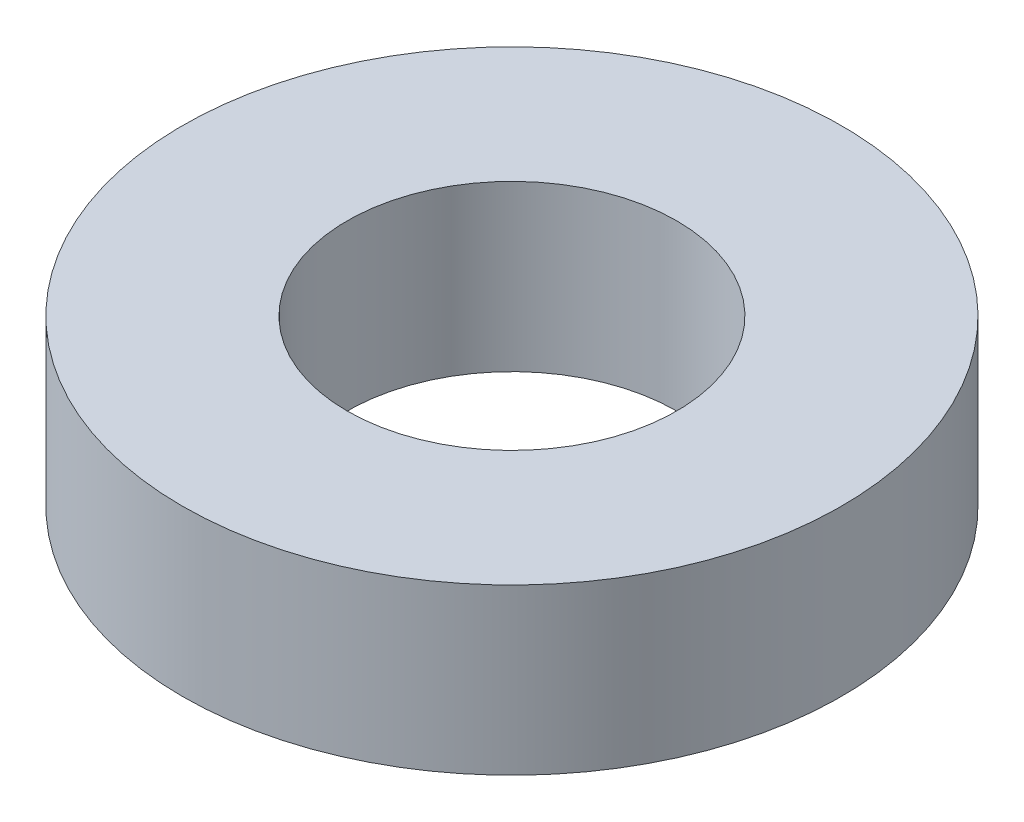
ISO-10303-21;
HEADER;
FILE_DESCRIPTION(('STEP AP214'),'2;1');
FILE_NAME('part.step','',(''),(''),'','','');
FILE_SCHEMA(('AUTOMOTIVE_DESIGN { 1 0 10303 214 1 1 1 1 }'));
ENDSEC;
DATA;
#1=APPLICATION_CONTEXT('core data for automotive mechanical design processes');
#2=APPLICATION_PROTOCOL_DEFINITION('international standard','automotive_design',2000,#1);
#3=PRODUCT_CONTEXT('',#1,'mechanical');
#4=PRODUCT('Part','Part','',(#3));
#5=PRODUCT_RELATED_PRODUCT_CATEGORY('part','',(#4));
#6=PRODUCT_DEFINITION_FORMATION('','',#4);
#7=PRODUCT_DEFINITION_CONTEXT('part definition',#1,'design');
#8=PRODUCT_DEFINITION('design','',#6,#7);
#9=PRODUCT_DEFINITION_SHAPE('','',#8);
#10=(LENGTH_UNIT() NAMED_UNIT(*) SI_UNIT(.MILLI.,.METRE.));
#11=(NAMED_UNIT(*) PLANE_ANGLE_UNIT() SI_UNIT($,.RADIAN.));
#12=(NAMED_UNIT(*) SI_UNIT($,.STERADIAN.) SOLID_ANGLE_UNIT());
#13=UNCERTAINTY_MEASURE_WITH_UNIT(LENGTH_MEASURE(1.E-05),#10,'distance_accuracy_value','');
#14=(GEOMETRIC_REPRESENTATION_CONTEXT(3) GLOBAL_UNCERTAINTY_ASSIGNED_CONTEXT((#13)) GLOBAL_UNIT_ASSIGNED_CONTEXT((#10,
#11,#12)) REPRESENTATION_CONTEXT('',''));
#15=CARTESIAN_POINT('',(0.,0.,0.));
#16=DIRECTION('',(0.,0.,1.));
#17=DIRECTION('',(1.,0.,0.));
#18=AXIS2_PLACEMENT_3D('',#15,#16,#17);
#19=CARTESIAN_POINT('',(0.,1.5,0.));
#20=DIRECTION('',(0.,-1.,0.));
#21=DIRECTION('',(0.,0.,-1.));
#22=AXIS2_PLACEMENT_3D('',#19,#20,#21);
#23=CYLINDRICAL_SURFACE('',#22,3.);
#24=CARTESIAN_POINT('',(0.,1.5,0.));
#25=DIRECTION('',(0.,1.,0.));
#26=DIRECTION('',(0.,0.,1.));
#27=AXIS2_PLACEMENT_3D('',#24,#25,#26);
#28=CIRCLE('',#27,3.);
#29=CARTESIAN_POINT('',(0.,1.5,3.));
#30=VERTEX_POINT('',#29);
#31=EDGE_CURVE('E10',#30,#30,#28,.T.);
#32=ORIENTED_EDGE('',*,*,#31,.F.);
#33=EDGE_LOOP('',(#32));
#34=FACE_BOUND('',#33,.T.);
#35=CARTESIAN_POINT('',(0.,0.,0.));
#36=DIRECTION('',(0.,1.,0.));
#37=DIRECTION('',(0.,0.,1.));
#38=AXIS2_PLACEMENT_3D('',#35,#36,#37);
#39=CIRCLE('',#38,3.);
#40=CARTESIAN_POINT('',(0.,0.,3.));
#41=VERTEX_POINT('',#40);
#42=EDGE_CURVE('E34',#41,#41,#39,.T.);
#43=ORIENTED_EDGE('',*,*,#42,.T.);
#44=EDGE_LOOP('',(#43));
#45=FACE_BOUND('',#44,.T.);
#46=ADVANCED_FACE('F31',(#34,#45),#23,.T.);
#47=CARTESIAN_POINT('',(0.,1.5,0.));
#48=DIRECTION('',(0.,1.,0.));
#49=DIRECTION('',(0.,0.,1.));
#50=AXIS2_PLACEMENT_3D('',#47,#48,#49);
#51=PLANE('',#50);
#52=CARTESIAN_POINT('',(0.,1.5,0.));
#53=DIRECTION('',(0.,1.,0.));
#54=DIRECTION('',(0.,0.,1.));
#55=AXIS2_PLACEMENT_3D('',#52,#53,#54);
#56=CIRCLE('',#55,1.5);
#57=CARTESIAN_POINT('',(0.,1.5,1.5));
#58=VERTEX_POINT('',#57);
#59=EDGE_CURVE('E45',#58,#58,#56,.T.);
#60=ORIENTED_EDGE('',*,*,#59,.F.);
#61=EDGE_LOOP('',(#60));
#62=FACE_BOUND('',#61,.T.);
#63=ORIENTED_EDGE('',*,*,#31,.T.);
#64=EDGE_LOOP('',(#63));
#65=FACE_BOUND('',#64,.T.);
#66=ADVANCED_FACE('F51',(#62,#65),#51,.T.);
#67=CARTESIAN_POINT('',(0.,0.,0.));
#68=DIRECTION('',(0.,1.,0.));
#69=DIRECTION('',(0.,0.,1.));
#70=AXIS2_PLACEMENT_3D('',#67,#68,#69);
#71=PLANE('',#70);
#72=CARTESIAN_POINT('',(0.,0.,0.));
#73=DIRECTION('',(0.,1.,0.));
#74=DIRECTION('',(0.,0.,1.));
#75=AXIS2_PLACEMENT_3D('',#72,#73,#74);
#76=CIRCLE('',#75,1.5);
#77=CARTESIAN_POINT('',(0.,0.,1.5));
#78=VERTEX_POINT('',#77);
#79=EDGE_CURVE('E41',#78,#78,#76,.F.);
#80=ORIENTED_EDGE('',*,*,#79,.F.);
#81=EDGE_LOOP('',(#80));
#82=FACE_BOUND('',#81,.T.);
#83=ORIENTED_EDGE('',*,*,#42,.F.);
#84=EDGE_LOOP('',(#83));
#85=FACE_BOUND('',#84,.T.);
#86=ADVANCED_FACE('F53',(#82,#85),#71,.F.);
#87=CARTESIAN_POINT('',(0.,-4.24264068711929,0.));
#88=DIRECTION('',(0.,1.,0.));
#89=DIRECTION('',(0.,0.,1.));
#90=AXIS2_PLACEMENT_3D('',#87,#88,#89);
#91=CYLINDRICAL_SURFACE('',#90,1.5);
#92=ORIENTED_EDGE('',*,*,#79,.T.);
#93=EDGE_LOOP('',(#92));
#94=FACE_BOUND('',#93,.T.);
#95=ORIENTED_EDGE('',*,*,#59,.T.);
#96=EDGE_LOOP('',(#95));
#97=FACE_BOUND('',#96,.T.);
#98=ADVANCED_FACE('F49',(#94,#97),#91,.F.);
#99=CLOSED_SHELL('',(#46,#66,#86,#98));
#100=MANIFOLD_SOLID_BREP('B2',#99);
#101=ADVANCED_BREP_SHAPE_REPRESENTATION('',(#18,#100),#14);
#102=SHAPE_DEFINITION_REPRESENTATION(#9,#101);
ENDSEC;
END-ISO-10303-21;
